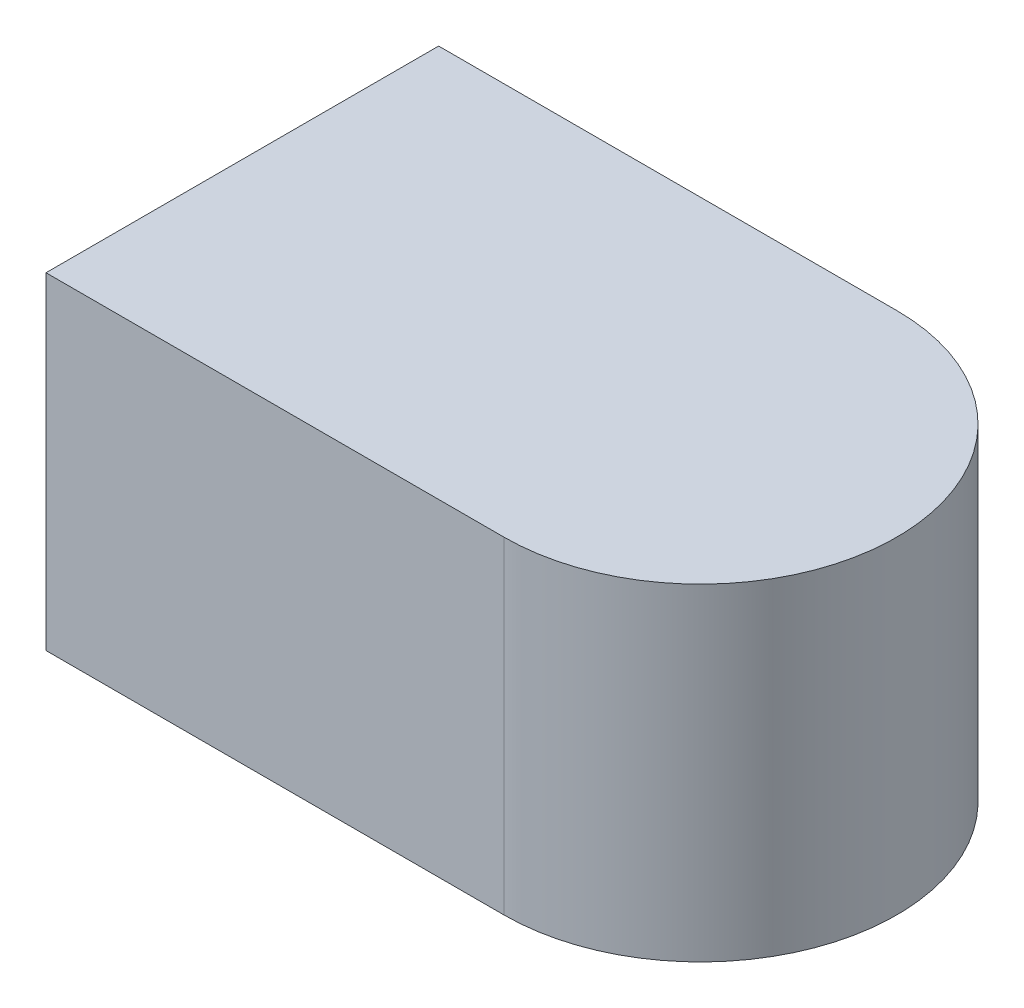
ISO-10303-21;
HEADER;
FILE_DESCRIPTION(('STEP AP214'),'2;1');
FILE_NAME('part.step','',(''),(''),'','','');
FILE_SCHEMA(('AUTOMOTIVE_DESIGN { 1 0 10303 214 1 1 1 1 }'));
ENDSEC;
DATA;
#1=APPLICATION_CONTEXT('core data for automotive mechanical design processes');
#2=APPLICATION_PROTOCOL_DEFINITION('international standard','automotive_design',2000,#1);
#3=PRODUCT_CONTEXT('',#1,'mechanical');
#4=PRODUCT('Part','Part','',(#3));
#5=PRODUCT_RELATED_PRODUCT_CATEGORY('part','',(#4));
#6=PRODUCT_DEFINITION_FORMATION('','',#4);
#7=PRODUCT_DEFINITION_CONTEXT('part definition',#1,'design');
#8=PRODUCT_DEFINITION('design','',#6,#7);
#9=PRODUCT_DEFINITION_SHAPE('','',#8);
#10=(LENGTH_UNIT() NAMED_UNIT(*) SI_UNIT(.MILLI.,.METRE.));
#11=(NAMED_UNIT(*) PLANE_ANGLE_UNIT() SI_UNIT($,.RADIAN.));
#12=(NAMED_UNIT(*) SI_UNIT($,.STERADIAN.) SOLID_ANGLE_UNIT());
#13=UNCERTAINTY_MEASURE_WITH_UNIT(LENGTH_MEASURE(1.E-05),#10,'distance_accuracy_value','');
#14=(GEOMETRIC_REPRESENTATION_CONTEXT(3) GLOBAL_UNCERTAINTY_ASSIGNED_CONTEXT((#13)) GLOBAL_UNIT_ASSIGNED_CONTEXT((#10,
#11,#12)) REPRESENTATION_CONTEXT('',''));
#15=CARTESIAN_POINT('',(0.,0.,0.));
#16=DIRECTION('',(0.,0.,1.));
#17=DIRECTION('',(1.,0.,0.));
#18=AXIS2_PLACEMENT_3D('',#15,#16,#17);
#19=CARTESIAN_POINT('',(0.,0.,0.));
#20=DIRECTION('',(0.,-1.,0.));
#21=DIRECTION('',(-1.,0.,0.));
#22=AXIS2_PLACEMENT_3D('',#19,#20,#21);
#23=PLANE('',#22);
#24=CARTESIAN_POINT('',(-1.47,0.,0.25));
#25=DIRECTION('',(0.,-1.,0.));
#26=DIRECTION('',(0.,0.,-1.));
#27=AXIS2_PLACEMENT_3D('',#24,#25,#26);
#28=CIRCLE('',#27,0.12);
#29=CARTESIAN_POINT('',(-1.47,0.,0.13));
#30=VERTEX_POINT('',#29);
#31=CARTESIAN_POINT('',(-1.47,0.,0.37));
#32=VERTEX_POINT('',#31);
#33=EDGE_CURVE('E11',#30,#32,#28,.T.);
#34=ORIENTED_EDGE('',*,*,#33,.T.);
#35=DIRECTION('',(-1.,0.,0.));
#36=VECTOR('',#35,1.);
#37=CARTESIAN_POINT('',(-1.47,0.,0.37));
#38=LINE('',#37,#36);
#39=CARTESIAN_POINT('',(-1.75,0.,0.37));
#40=VERTEX_POINT('',#39);
#41=EDGE_CURVE('E24',#32,#40,#38,.T.);
#42=ORIENTED_EDGE('',*,*,#41,.T.);
#43=DIRECTION('',(0.,0.,-1.));
#44=VECTOR('',#43,1.);
#45=CARTESIAN_POINT('',(-1.75,0.,0.37));
#46=LINE('',#45,#44);
#47=CARTESIAN_POINT('',(-1.75,0.,0.13));
#48=VERTEX_POINT('',#47);
#49=EDGE_CURVE('E62',#40,#48,#46,.T.);
#50=ORIENTED_EDGE('',*,*,#49,.T.);
#51=DIRECTION('',(1.,0.,0.));
#52=VECTOR('',#51,1.);
#53=CARTESIAN_POINT('',(-1.75,0.,0.13));
#54=LINE('',#53,#52);
#55=EDGE_CURVE('E36',#48,#30,#54,.T.);
#56=ORIENTED_EDGE('',*,*,#55,.T.);
#57=EDGE_LOOP('',(#34,#42,#50,#56));
#58=FACE_BOUND('',#57,.T.);
#59=ADVANCED_FACE('F17',(#58),#23,.T.);
#60=CARTESIAN_POINT('',(-1.75,0.,0.13));
#61=DIRECTION('',(0.,0.,1.));
#62=DIRECTION('',(1.,0.,0.));
#63=AXIS2_PLACEMENT_3D('',#60,#61,#62);
#64=PLANE('',#63);
#65=DIRECTION('',(0.,1.,0.));
#66=VECTOR('',#65,1.);
#67=CARTESIAN_POINT('',(-1.75,0.,0.13));
#68=LINE('',#67,#66);
#69=CARTESIAN_POINT('',(-1.75,0.2,0.13));
#70=VERTEX_POINT('',#69);
#71=EDGE_CURVE('E84',#48,#70,#68,.T.);
#72=ORIENTED_EDGE('',*,*,#71,.T.);
#73=DIRECTION('',(1.,0.,0.));
#74=VECTOR('',#73,1.);
#75=CARTESIAN_POINT('',(-1.75,0.2,0.13));
#76=LINE('',#75,#74);
#77=CARTESIAN_POINT('',(-1.47,0.2,0.13));
#78=VERTEX_POINT('',#77);
#79=EDGE_CURVE('E74',#70,#78,#76,.T.);
#80=ORIENTED_EDGE('',*,*,#79,.T.);
#81=DIRECTION('',(0.,1.,0.));
#82=VECTOR('',#81,1.);
#83=CARTESIAN_POINT('',(-1.47,0.,0.13));
#84=LINE('',#83,#82);
#85=EDGE_CURVE('E81',#30,#78,#84,.T.);
#86=ORIENTED_EDGE('',*,*,#85,.F.);
#87=ORIENTED_EDGE('',*,*,#55,.F.);
#88=EDGE_LOOP('',(#72,#80,#86,#87));
#89=FACE_BOUND('',#88,.T.);
#90=ADVANCED_FACE('F91',(#89),#64,.F.);
#91=CARTESIAN_POINT('',(-1.47,0.,0.25));
#92=DIRECTION('',(0.,-1.,0.));
#93=DIRECTION('',(-1.,0.,0.));
#94=AXIS2_PLACEMENT_3D('',#91,#92,#93);
#95=CYLINDRICAL_SURFACE('',#94,0.12);
#96=ORIENTED_EDGE('',*,*,#85,.T.);
#97=CARTESIAN_POINT('',(-1.47,0.2,0.25));
#98=DIRECTION('',(0.,-1.,0.));
#99=DIRECTION('',(0.,0.,-1.));
#100=AXIS2_PLACEMENT_3D('',#97,#98,#99);
#101=CIRCLE('',#100,0.12);
#102=CARTESIAN_POINT('',(-1.47,0.2,0.37));
#103=VERTEX_POINT('',#102);
#104=EDGE_CURVE('E79',#78,#103,#101,.T.);
#105=ORIENTED_EDGE('',*,*,#104,.T.);
#106=DIRECTION('',(0.,1.,0.));
#107=VECTOR('',#106,1.);
#108=CARTESIAN_POINT('',(-1.47,0.,0.37));
#109=LINE('',#108,#107);
#110=EDGE_CURVE('E68',#32,#103,#109,.T.);
#111=ORIENTED_EDGE('',*,*,#110,.F.);
#112=ORIENTED_EDGE('',*,*,#33,.F.);
#113=EDGE_LOOP('',(#96,#105,#111,#112));
#114=FACE_BOUND('',#113,.T.);
#115=ADVANCED_FACE('F89',(#114),#95,.T.);
#116=CARTESIAN_POINT('',(-1.47,0.,0.37));
#117=DIRECTION('',(0.,0.,-1.));
#118=DIRECTION('',(-1.,0.,0.));
#119=AXIS2_PLACEMENT_3D('',#116,#117,#118);
#120=PLANE('',#119);
#121=ORIENTED_EDGE('',*,*,#110,.T.);
#122=DIRECTION('',(-1.,0.,0.));
#123=VECTOR('',#122,1.);
#124=CARTESIAN_POINT('',(-1.47,0.2,0.37));
#125=LINE('',#124,#123);
#126=CARTESIAN_POINT('',(-1.75,0.2,0.37));
#127=VERTEX_POINT('',#126);
#128=EDGE_CURVE('E63',#103,#127,#125,.T.);
#129=ORIENTED_EDGE('',*,*,#128,.T.);
#130=DIRECTION('',(0.,1.,0.));
#131=VECTOR('',#130,1.);
#132=CARTESIAN_POINT('',(-1.75,0.,0.37));
#133=LINE('',#132,#131);
#134=EDGE_CURVE('E56',#40,#127,#133,.T.);
#135=ORIENTED_EDGE('',*,*,#134,.F.);
#136=ORIENTED_EDGE('',*,*,#41,.F.);
#137=EDGE_LOOP('',(#121,#129,#135,#136));
#138=FACE_BOUND('',#137,.T.);
#139=ADVANCED_FACE('F66',(#138),#120,.F.);
#140=CARTESIAN_POINT('',(-1.75,0.,0.37));
#141=DIRECTION('',(1.,0.,0.));
#142=DIRECTION('',(0.,0.,-1.));
#143=AXIS2_PLACEMENT_3D('',#140,#141,#142);
#144=PLANE('',#143);
#145=ORIENTED_EDGE('',*,*,#134,.T.);
#146=DIRECTION('',(0.,0.,-1.));
#147=VECTOR('',#146,1.);
#148=CARTESIAN_POINT('',(-1.75,0.2,0.37));
#149=LINE('',#148,#147);
#150=EDGE_CURVE('E61',#127,#70,#149,.T.);
#151=ORIENTED_EDGE('',*,*,#150,.T.);
#152=ORIENTED_EDGE('',*,*,#71,.F.);
#153=ORIENTED_EDGE('',*,*,#49,.F.);
#154=EDGE_LOOP('',(#145,#151,#152,#153));
#155=FACE_BOUND('',#154,.T.);
#156=ADVANCED_FACE('F58',(#155),#144,.F.);
#157=CARTESIAN_POINT('',(0.,0.2,0.));
#158=DIRECTION('',(0.,-1.,0.));
#159=DIRECTION('',(-1.,0.,0.));
#160=AXIS2_PLACEMENT_3D('',#157,#158,#159);
#161=PLANE('',#160);
#162=ORIENTED_EDGE('',*,*,#150,.F.);
#163=ORIENTED_EDGE('',*,*,#128,.F.);
#164=ORIENTED_EDGE('',*,*,#104,.F.);
#165=ORIENTED_EDGE('',*,*,#79,.F.);
#166=EDGE_LOOP('',(#162,#163,#164,#165));
#167=FACE_BOUND('',#166,.T.);
#168=ADVANCED_FACE('F72',(#167),#161,.F.);
#169=CLOSED_SHELL('',(#59,#90,#115,#139,#156,#168));
#170=MANIFOLD_SOLID_BREP('B1',#169);
#171=ADVANCED_BREP_SHAPE_REPRESENTATION('',(#18,#170),#14);
#172=SHAPE_DEFINITION_REPRESENTATION(#9,#171);
ENDSEC;
END-ISO-10303-21;
